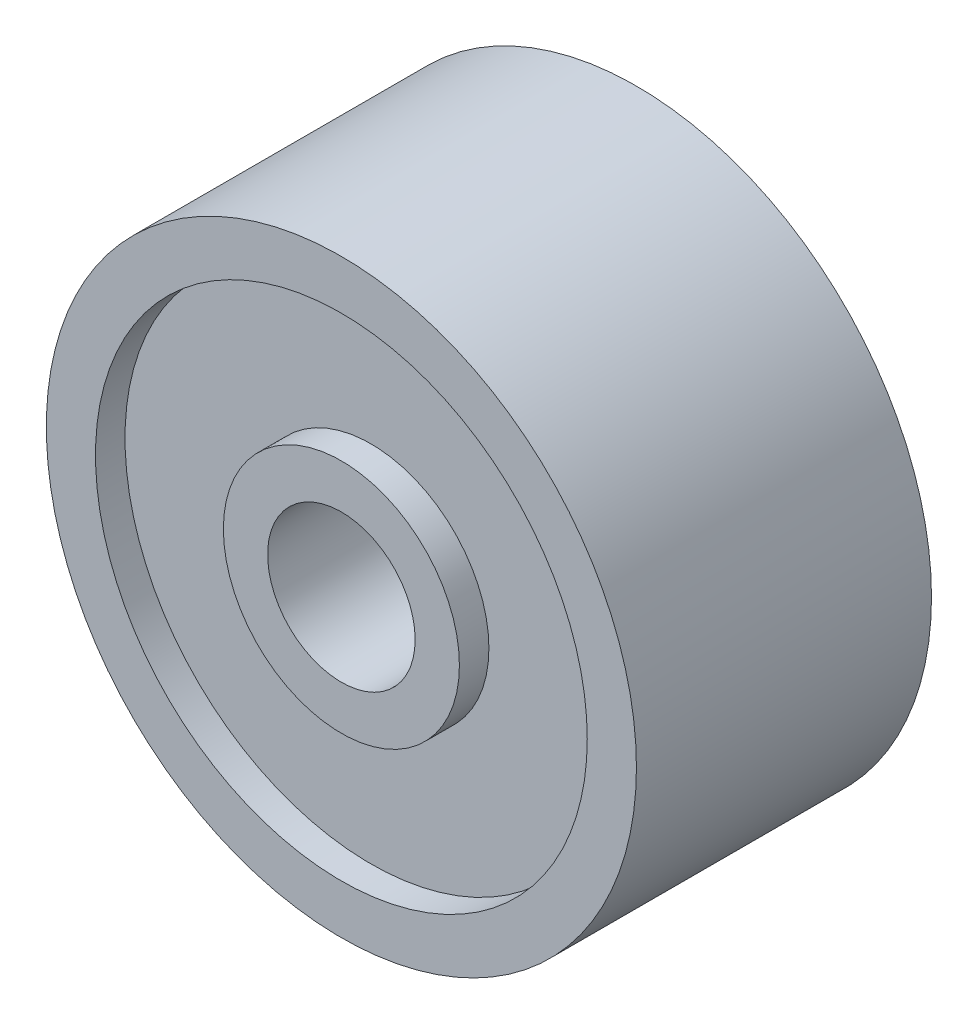
ISO-10303-21;
HEADER;
FILE_DESCRIPTION(('STEP AP214'),'2;1');
FILE_NAME('part.step','',(''),(''),'','','');
FILE_SCHEMA(('AUTOMOTIVE_DESIGN { 1 0 10303 214 1 1 1 1 }'));
ENDSEC;
DATA;
#1=APPLICATION_CONTEXT('core data for automotive mechanical design processes');
#2=APPLICATION_PROTOCOL_DEFINITION('international standard','automotive_design',2000,#1);
#3=PRODUCT_CONTEXT('',#1,'mechanical');
#4=PRODUCT('Part','Part','',(#3));
#5=PRODUCT_RELATED_PRODUCT_CATEGORY('part','',(#4));
#6=PRODUCT_DEFINITION_FORMATION('','',#4);
#7=PRODUCT_DEFINITION_CONTEXT('part definition',#1,'design');
#8=PRODUCT_DEFINITION('design','',#6,#7);
#9=PRODUCT_DEFINITION_SHAPE('','',#8);
#10=(LENGTH_UNIT() NAMED_UNIT(*) SI_UNIT(.MILLI.,.METRE.));
#11=(NAMED_UNIT(*) PLANE_ANGLE_UNIT() SI_UNIT($,.RADIAN.));
#12=(NAMED_UNIT(*) SI_UNIT($,.STERADIAN.) SOLID_ANGLE_UNIT());
#13=UNCERTAINTY_MEASURE_WITH_UNIT(LENGTH_MEASURE(1.E-05),#10,'distance_accuracy_value','');
#14=(GEOMETRIC_REPRESENTATION_CONTEXT(3) GLOBAL_UNCERTAINTY_ASSIGNED_CONTEXT((#13)) GLOBAL_UNIT_ASSIGNED_CONTEXT((#10,
#11,#12)) REPRESENTATION_CONTEXT('',''));
#15=CARTESIAN_POINT('',(0.,0.,0.));
#16=DIRECTION('',(0.,0.,1.));
#17=DIRECTION('',(1.,0.,0.));
#18=AXIS2_PLACEMENT_3D('',#15,#16,#17);
#19=CARTESIAN_POINT('',(0.,0.,0.));
#20=DIRECTION('',(0.,0.,1.));
#21=DIRECTION('',(1.,0.,0.));
#22=AXIS2_PLACEMENT_3D('',#19,#20,#21);
#23=PLANE('',#22);
#24=CARTESIAN_POINT('',(0.,0.,0.));
#25=DIRECTION('',(0.,0.,1.));
#26=DIRECTION('',(1.,0.,0.));
#27=AXIS2_PLACEMENT_3D('',#24,#25,#26);
#28=CIRCLE('',#27,0.75);
#29=CARTESIAN_POINT('',(0.75,0.,0.));
#30=VERTEX_POINT('',#29);
#31=EDGE_CURVE('E46',#30,#30,#28,.T.);
#32=ORIENTED_EDGE('',*,*,#31,.T.);
#33=EDGE_LOOP('',(#32));
#34=FACE_BOUND('',#33,.T.);
#35=CARTESIAN_POINT('',(0.,0.,0.));
#36=DIRECTION('',(0.,0.,1.));
#37=DIRECTION('',(1.,0.,0.));
#38=AXIS2_PLACEMENT_3D('',#35,#36,#37);
#39=CIRCLE('',#38,1.2);
#40=CARTESIAN_POINT('',(1.2,0.,0.));
#41=VERTEX_POINT('',#40);
#42=EDGE_CURVE('E70',#41,#41,#39,.T.);
#43=ORIENTED_EDGE('',*,*,#42,.F.);
#44=EDGE_LOOP('',(#43));
#45=FACE_BOUND('',#44,.T.);
#46=ADVANCED_FACE('F33',(#34,#45),#23,.F.);
#47=CARTESIAN_POINT('',(0.,0.,3.));
#48=DIRECTION('',(0.,0.,1.));
#49=DIRECTION('',(1.,0.,0.));
#50=AXIS2_PLACEMENT_3D('',#47,#48,#49);
#51=PLANE('',#50);
#52=CARTESIAN_POINT('',(0.,0.,3.));
#53=DIRECTION('',(0.,0.,1.));
#54=DIRECTION('',(1.,0.,0.));
#55=AXIS2_PLACEMENT_3D('',#52,#53,#54);
#56=CIRCLE('',#55,0.75);
#57=CARTESIAN_POINT('',(0.75,0.,3.));
#58=VERTEX_POINT('',#57);
#59=EDGE_CURVE('E44',#58,#58,#56,.T.);
#60=ORIENTED_EDGE('',*,*,#59,.F.);
#61=EDGE_LOOP('',(#60));
#62=FACE_BOUND('',#61,.T.);
#63=CARTESIAN_POINT('',(0.,0.,3.));
#64=DIRECTION('',(0.,0.,1.));
#65=DIRECTION('',(1.,0.,0.));
#66=AXIS2_PLACEMENT_3D('',#63,#64,#65);
#67=CIRCLE('',#66,1.2);
#68=CARTESIAN_POINT('',(1.2,0.,3.));
#69=VERTEX_POINT('',#68);
#70=EDGE_CURVE('E58',#69,#69,#67,.T.);
#71=ORIENTED_EDGE('',*,*,#70,.T.);
#72=EDGE_LOOP('',(#71));
#73=FACE_BOUND('',#72,.T.);
#74=ADVANCED_FACE('F86',(#62,#73),#51,.T.);
#75=CARTESIAN_POINT('',(0.,0.,3.));
#76=DIRECTION('',(0.,0.,1.));
#77=DIRECTION('',(1.,0.,0.));
#78=AXIS2_PLACEMENT_3D('',#75,#76,#77);
#79=CIRCLE('',#78,2.5);
#80=CARTESIAN_POINT('',(2.5,0.,3.));
#81=VERTEX_POINT('',#80);
#82=EDGE_CURVE('E52',#81,#81,#79,.T.);
#83=ORIENTED_EDGE('',*,*,#82,.F.);
#84=EDGE_LOOP('',(#83));
#85=FACE_BOUND('',#84,.T.);
#86=CARTESIAN_POINT('',(0.,0.,3.));
#87=DIRECTION('',(0.,0.,1.));
#88=DIRECTION('',(1.,0.,0.));
#89=AXIS2_PLACEMENT_3D('',#86,#87,#88);
#90=CIRCLE('',#89,3.);
#91=CARTESIAN_POINT('',(3.,0.,3.));
#92=VERTEX_POINT('',#91);
#93=EDGE_CURVE('E10',#92,#92,#90,.T.);
#94=ORIENTED_EDGE('',*,*,#93,.T.);
#95=EDGE_LOOP('',(#94));
#96=FACE_BOUND('',#95,.T.);
#97=ADVANCED_FACE('F92',(#85,#96),#51,.T.);
#98=CARTESIAN_POINT('',(0.,0.,0.));
#99=DIRECTION('',(0.,0.,1.));
#100=DIRECTION('',(1.,0.,0.));
#101=AXIS2_PLACEMENT_3D('',#98,#99,#100);
#102=CIRCLE('',#101,2.5);
#103=CARTESIAN_POINT('',(2.5,0.,0.));
#104=VERTEX_POINT('',#103);
#105=EDGE_CURVE('E64',#104,#104,#102,.T.);
#106=ORIENTED_EDGE('',*,*,#105,.T.);
#107=EDGE_LOOP('',(#106));
#108=FACE_BOUND('',#107,.T.);
#109=CARTESIAN_POINT('',(0.,0.,0.));
#110=DIRECTION('',(0.,0.,1.));
#111=DIRECTION('',(1.,0.,0.));
#112=AXIS2_PLACEMENT_3D('',#109,#110,#111);
#113=CIRCLE('',#112,3.);
#114=CARTESIAN_POINT('',(3.,0.,0.));
#115=VERTEX_POINT('',#114);
#116=EDGE_CURVE('E37',#115,#115,#113,.T.);
#117=ORIENTED_EDGE('',*,*,#116,.F.);
#118=EDGE_LOOP('',(#117));
#119=FACE_BOUND('',#118,.T.);
#120=ADVANCED_FACE('F88',(#108,#119),#23,.F.);
#121=CARTESIAN_POINT('',(0.,0.,3.));
#122=DIRECTION('',(0.,0.,-1.));
#123=DIRECTION('',(-1.,0.,0.));
#124=AXIS2_PLACEMENT_3D('',#121,#122,#123);
#125=CYLINDRICAL_SURFACE('',#124,3.);
#126=ORIENTED_EDGE('',*,*,#93,.F.);
#127=EDGE_LOOP('',(#126));
#128=FACE_BOUND('',#127,.T.);
#129=ORIENTED_EDGE('',*,*,#116,.T.);
#130=EDGE_LOOP('',(#129));
#131=FACE_BOUND('',#130,.T.);
#132=ADVANCED_FACE('F35',(#128,#131),#125,.T.);
#133=CARTESIAN_POINT('',(0.,0.,3.));
#134=DIRECTION('',(0.,0.,-1.));
#135=DIRECTION('',(-1.,0.,0.));
#136=AXIS2_PLACEMENT_3D('',#133,#134,#135);
#137=CYLINDRICAL_SURFACE('',#136,0.75);
#138=ORIENTED_EDGE('',*,*,#59,.T.);
#139=EDGE_LOOP('',(#138));
#140=FACE_BOUND('',#139,.T.);
#141=ORIENTED_EDGE('',*,*,#31,.F.);
#142=EDGE_LOOP('',(#141));
#143=FACE_BOUND('',#142,.T.);
#144=ADVANCED_FACE('F101',(#140,#143),#137,.F.);
#145=CARTESIAN_POINT('',(0.,0.,2.7));
#146=DIRECTION('',(0.,0.,1.));
#147=DIRECTION('',(1.,0.,0.));
#148=AXIS2_PLACEMENT_3D('',#145,#146,#147);
#149=CYLINDRICAL_SURFACE('',#148,2.5);
#150=CARTESIAN_POINT('',(0.,0.,2.7));
#151=DIRECTION('',(0.,0.,1.));
#152=DIRECTION('',(1.,0.,0.));
#153=AXIS2_PLACEMENT_3D('',#150,#151,#152);
#154=CIRCLE('',#153,2.5);
#155=CARTESIAN_POINT('',(2.5,0.,2.7));
#156=VERTEX_POINT('',#155);
#157=EDGE_CURVE('E49',#156,#156,#154,.T.);
#158=ORIENTED_EDGE('',*,*,#157,.F.);
#159=EDGE_LOOP('',(#158));
#160=FACE_BOUND('',#159,.T.);
#161=ORIENTED_EDGE('',*,*,#82,.T.);
#162=EDGE_LOOP('',(#161));
#163=FACE_BOUND('',#162,.T.);
#164=ADVANCED_FACE('F125',(#160,#163),#149,.F.);
#165=CARTESIAN_POINT('',(0.,0.,2.7));
#166=DIRECTION('',(0.,0.,1.));
#167=DIRECTION('',(1.,0.,0.));
#168=AXIS2_PLACEMENT_3D('',#165,#166,#167);
#169=PLANE('',#168);
#170=CARTESIAN_POINT('',(0.,0.,2.7));
#171=DIRECTION('',(0.,0.,1.));
#172=DIRECTION('',(1.,0.,0.));
#173=AXIS2_PLACEMENT_3D('',#170,#171,#172);
#174=CIRCLE('',#173,1.2);
#175=CARTESIAN_POINT('',(1.2,0.,2.7));
#176=VERTEX_POINT('',#175);
#177=EDGE_CURVE('E55',#176,#176,#174,.T.);
#178=ORIENTED_EDGE('',*,*,#177,.F.);
#179=EDGE_LOOP('',(#178));
#180=FACE_BOUND('',#179,.T.);
#181=ORIENTED_EDGE('',*,*,#157,.T.);
#182=EDGE_LOOP('',(#181));
#183=FACE_BOUND('',#182,.T.);
#184=ADVANCED_FACE('F121',(#180,#183),#169,.T.);
#185=CARTESIAN_POINT('',(0.,0.,2.7));
#186=DIRECTION('',(0.,0.,1.));
#187=DIRECTION('',(1.,0.,0.));
#188=AXIS2_PLACEMENT_3D('',#185,#186,#187);
#189=CYLINDRICAL_SURFACE('',#188,1.2);
#190=ORIENTED_EDGE('',*,*,#177,.T.);
#191=EDGE_LOOP('',(#190));
#192=FACE_BOUND('',#191,.T.);
#193=ORIENTED_EDGE('',*,*,#70,.F.);
#194=EDGE_LOOP('',(#193));
#195=FACE_BOUND('',#194,.T.);
#196=ADVANCED_FACE('F115',(#192,#195),#189,.T.);
#197=CARTESIAN_POINT('',(0.,0.,0.3));
#198=DIRECTION('',(0.,0.,1.));
#199=DIRECTION('',(1.,0.,0.));
#200=AXIS2_PLACEMENT_3D('',#197,#198,#199);
#201=PLANE('',#200);
#202=CARTESIAN_POINT('',(0.,0.,0.3));
#203=DIRECTION('',(0.,0.,1.));
#204=DIRECTION('',(1.,0.,0.));
#205=AXIS2_PLACEMENT_3D('',#202,#203,#204);
#206=CIRCLE('',#205,2.5);
#207=CARTESIAN_POINT('',(2.5,0.,0.3));
#208=VERTEX_POINT('',#207);
#209=EDGE_CURVE('E61',#208,#208,#206,.T.);
#210=ORIENTED_EDGE('',*,*,#209,.F.);
#211=EDGE_LOOP('',(#210));
#212=FACE_BOUND('',#211,.T.);
#213=CARTESIAN_POINT('',(0.,0.,0.3));
#214=DIRECTION('',(0.,0.,1.));
#215=DIRECTION('',(1.,0.,0.));
#216=AXIS2_PLACEMENT_3D('',#213,#214,#215);
#217=CIRCLE('',#216,1.2);
#218=CARTESIAN_POINT('',(1.2,0.,0.3));
#219=VERTEX_POINT('',#218);
#220=EDGE_CURVE('E67',#219,#219,#217,.T.);
#221=ORIENTED_EDGE('',*,*,#220,.T.);
#222=EDGE_LOOP('',(#221));
#223=FACE_BOUND('',#222,.T.);
#224=ADVANCED_FACE('F76',(#212,#223),#201,.F.);
#225=CARTESIAN_POINT('',(0.,0.,0.3));
#226=DIRECTION('',(0.,0.,-1.));
#227=DIRECTION('',(-1.,0.,0.));
#228=AXIS2_PLACEMENT_3D('',#225,#226,#227);
#229=CYLINDRICAL_SURFACE('',#228,2.5);
#230=ORIENTED_EDGE('',*,*,#209,.T.);
#231=EDGE_LOOP('',(#230));
#232=FACE_BOUND('',#231,.T.);
#233=ORIENTED_EDGE('',*,*,#105,.F.);
#234=EDGE_LOOP('',(#233));
#235=FACE_BOUND('',#234,.T.);
#236=ADVANCED_FACE('F81',(#232,#235),#229,.F.);
#237=CARTESIAN_POINT('',(0.,0.,0.3));
#238=DIRECTION('',(0.,0.,-1.));
#239=DIRECTION('',(-1.,0.,0.));
#240=AXIS2_PLACEMENT_3D('',#237,#238,#239);
#241=CYLINDRICAL_SURFACE('',#240,1.2);
#242=ORIENTED_EDGE('',*,*,#220,.F.);
#243=EDGE_LOOP('',(#242));
#244=FACE_BOUND('',#243,.T.);
#245=ORIENTED_EDGE('',*,*,#42,.T.);
#246=EDGE_LOOP('',(#245));
#247=FACE_BOUND('',#246,.T.);
#248=ADVANCED_FACE('F78',(#244,#247),#241,.T.);
#249=CLOSED_SHELL('',(#46,#74,#97,#120,#132,#144,#164,#184,#196,#224,#236,#248));
#250=MANIFOLD_SOLID_BREP('B2',#249);
#251=ADVANCED_BREP_SHAPE_REPRESENTATION('',(#18,#250),#14);
#252=SHAPE_DEFINITION_REPRESENTATION(#9,#251);
ENDSEC;
END-ISO-10303-21;
